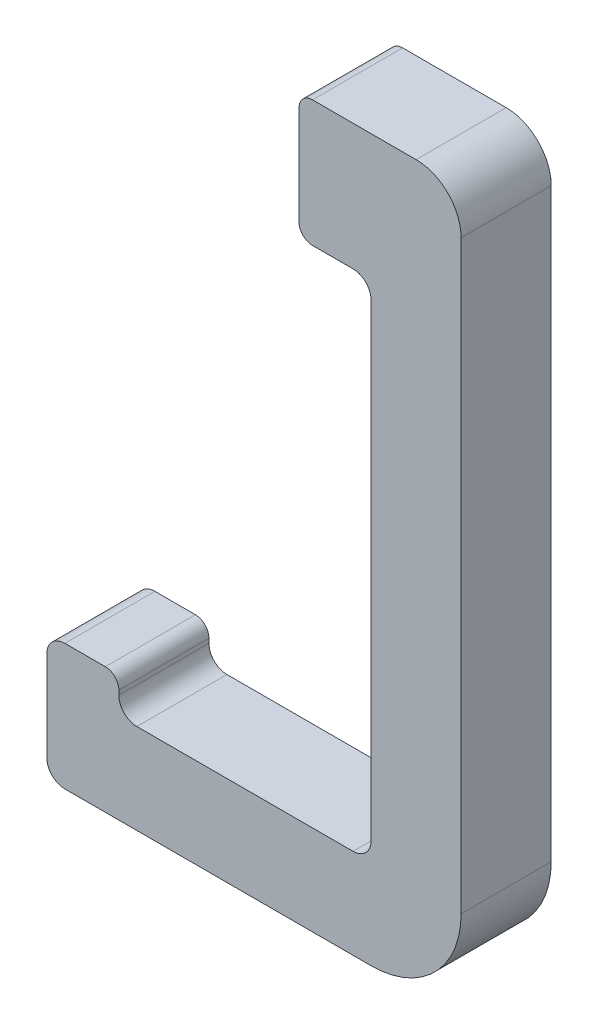
ISO-10303-21;
HEADER;
FILE_DESCRIPTION(('STEP AP214'),'2;1');
FILE_NAME('part.step','',(''),(''),'','','');
FILE_SCHEMA(('AUTOMOTIVE_DESIGN { 1 0 10303 214 1 1 1 1 }'));
ENDSEC;
DATA;
#1=APPLICATION_CONTEXT('core data for automotive mechanical design processes');
#2=APPLICATION_PROTOCOL_DEFINITION('international standard','automotive_design',2000,#1);
#3=PRODUCT_CONTEXT('',#1,'mechanical');
#4=PRODUCT('Part','Part','',(#3));
#5=PRODUCT_RELATED_PRODUCT_CATEGORY('part','',(#4));
#6=PRODUCT_DEFINITION_FORMATION('','',#4);
#7=PRODUCT_DEFINITION_CONTEXT('part definition',#1,'design');
#8=PRODUCT_DEFINITION('design','',#6,#7);
#9=PRODUCT_DEFINITION_SHAPE('','',#8);
#10=(LENGTH_UNIT() NAMED_UNIT(*) SI_UNIT(.MILLI.,.METRE.));
#11=(NAMED_UNIT(*) PLANE_ANGLE_UNIT() SI_UNIT($,.RADIAN.));
#12=(NAMED_UNIT(*) SI_UNIT($,.STERADIAN.) SOLID_ANGLE_UNIT());
#13=UNCERTAINTY_MEASURE_WITH_UNIT(LENGTH_MEASURE(1.E-05),#10,'distance_accuracy_value','');
#14=(GEOMETRIC_REPRESENTATION_CONTEXT(3) GLOBAL_UNCERTAINTY_ASSIGNED_CONTEXT((#13)) GLOBAL_UNIT_ASSIGNED_CONTEXT((#10,
#11,#12)) REPRESENTATION_CONTEXT('',''));
#15=CARTESIAN_POINT('',(0.,0.,0.));
#16=DIRECTION('',(0.,0.,1.));
#17=DIRECTION('',(1.,0.,0.));
#18=AXIS2_PLACEMENT_3D('',#15,#16,#17);
#19=CARTESIAN_POINT('',(-26.,12.,10.));
#20=DIRECTION('',(0.,0.,-1.));
#21=DIRECTION('',(-1.,0.,0.));
#22=AXIS2_PLACEMENT_3D('',#19,#20,#21);
#23=CYLINDRICAL_SURFACE('',#22,2.);
#24=CARTESIAN_POINT('',(-26.,12.,0.));
#25=DIRECTION('',(0.,0.,-1.));
#26=DIRECTION('',(1.,0.,0.));
#27=AXIS2_PLACEMENT_3D('',#24,#25,#26);
#28=CIRCLE('',#27,2.);
#29=CARTESIAN_POINT('',(-26.,10.,0.));
#30=VERTEX_POINT('',#29);
#31=CARTESIAN_POINT('',(-28.,12.,0.));
#32=VERTEX_POINT('',#31);
#33=EDGE_CURVE('E203',#30,#32,#28,.T.);
#34=ORIENTED_EDGE('',*,*,#33,.T.);
#35=DIRECTION('',(0.,0.,-1.));
#36=VECTOR('',#35,1.);
#37=CARTESIAN_POINT('',(-28.,12.,10.));
#38=LINE('',#37,#36);
#39=CARTESIAN_POINT('',(-28.,12.,10.));
#40=VERTEX_POINT('',#39);
#41=EDGE_CURVE('E11',#40,#32,#38,.T.);
#42=ORIENTED_EDGE('',*,*,#41,.F.);
#43=CARTESIAN_POINT('',(-26.,12.,10.));
#44=DIRECTION('',(0.,0.,-1.));
#45=DIRECTION('',(1.,0.,0.));
#46=AXIS2_PLACEMENT_3D('',#43,#44,#45);
#47=CIRCLE('',#46,2.);
#48=CARTESIAN_POINT('',(-26.,10.,10.));
#49=VERTEX_POINT('',#48);
#50=EDGE_CURVE('E243',#49,#40,#47,.T.);
#51=ORIENTED_EDGE('',*,*,#50,.F.);
#52=DIRECTION('',(0.,0.,-1.));
#53=VECTOR('',#52,1.);
#54=CARTESIAN_POINT('',(-26.,10.,10.));
#55=LINE('',#54,#53);
#56=EDGE_CURVE('E199',#49,#30,#55,.T.);
#57=ORIENTED_EDGE('',*,*,#56,.T.);
#58=EDGE_LOOP('',(#34,#42,#51,#57));
#59=FACE_BOUND('',#58,.T.);
#60=ADVANCED_FACE('F35',(#59),#23,.F.);
#61=CARTESIAN_POINT('',(-28.,12.5,10.));
#62=DIRECTION('',(-1.,0.,0.));
#63=DIRECTION('',(0.,0.,1.));
#64=AXIS2_PLACEMENT_3D('',#61,#62,#63);
#65=PLANE('',#64);
#66=DIRECTION('',(0.,1.,0.));
#67=VECTOR('',#66,1.);
#68=CARTESIAN_POINT('',(-28.,12.5,0.));
#69=LINE('',#68,#67);
#70=CARTESIAN_POINT('',(-28.,12.5,0.));
#71=VERTEX_POINT('',#70);
#72=EDGE_CURVE('E206',#32,#71,#69,.T.);
#73=ORIENTED_EDGE('',*,*,#72,.T.);
#74=DIRECTION('',(0.,0.,-1.));
#75=VECTOR('',#74,1.);
#76=CARTESIAN_POINT('',(-28.,12.5,10.));
#77=LINE('',#76,#75);
#78=CARTESIAN_POINT('',(-28.,12.5,10.));
#79=VERTEX_POINT('',#78);
#80=EDGE_CURVE('E43',#79,#71,#77,.T.);
#81=ORIENTED_EDGE('',*,*,#80,.F.);
#82=DIRECTION('',(0.,1.,0.));
#83=VECTOR('',#82,1.);
#84=CARTESIAN_POINT('',(-28.,12.5,10.));
#85=LINE('',#84,#83);
#86=EDGE_CURVE('E128',#40,#79,#85,.T.);
#87=ORIENTED_EDGE('',*,*,#86,.F.);
#88=ORIENTED_EDGE('',*,*,#41,.T.);
#89=EDGE_LOOP('',(#73,#81,#87,#88));
#90=FACE_BOUND('',#89,.T.);
#91=ADVANCED_FACE('F352',(#90),#65,.F.);
#92=CARTESIAN_POINT('',(-29.5,12.5,10.));
#93=DIRECTION('',(0.,0.,-1.));
#94=DIRECTION('',(-1.,0.,0.));
#95=AXIS2_PLACEMENT_3D('',#92,#93,#94);
#96=CYLINDRICAL_SURFACE('',#95,1.5);
#97=CARTESIAN_POINT('',(-29.5,12.5,0.));
#98=DIRECTION('',(0.,0.,1.));
#99=DIRECTION('',(1.,0.,0.));
#100=AXIS2_PLACEMENT_3D('',#97,#98,#99);
#101=CIRCLE('',#100,1.5);
#102=CARTESIAN_POINT('',(-29.5,14.,0.));
#103=VERTEX_POINT('',#102);
#104=EDGE_CURVE('E208',#71,#103,#101,.T.);
#105=ORIENTED_EDGE('',*,*,#104,.T.);
#106=DIRECTION('',(0.,0.,-1.));
#107=VECTOR('',#106,1.);
#108=CARTESIAN_POINT('',(-29.5,14.,10.));
#109=LINE('',#108,#107);
#110=CARTESIAN_POINT('',(-29.5,14.,10.));
#111=VERTEX_POINT('',#110);
#112=EDGE_CURVE('E286',#111,#103,#109,.T.);
#113=ORIENTED_EDGE('',*,*,#112,.F.);
#114=CARTESIAN_POINT('',(-29.5,12.5,10.));
#115=DIRECTION('',(0.,0.,1.));
#116=DIRECTION('',(1.,0.,0.));
#117=AXIS2_PLACEMENT_3D('',#114,#115,#116);
#118=CIRCLE('',#117,1.5);
#119=EDGE_CURVE('E294',#79,#111,#118,.T.);
#120=ORIENTED_EDGE('',*,*,#119,.F.);
#121=ORIENTED_EDGE('',*,*,#80,.T.);
#122=EDGE_LOOP('',(#105,#113,#120,#121));
#123=FACE_BOUND('',#122,.T.);
#124=ADVANCED_FACE('F292',(#123),#96,.T.);
#125=CARTESIAN_POINT('',(-29.5,14.,10.));
#126=DIRECTION('',(0.,-1.,0.));
#127=DIRECTION('',(0.,0.,-1.));
#128=AXIS2_PLACEMENT_3D('',#125,#126,#127);
#129=PLANE('',#128);
#130=DIRECTION('',(-1.,0.,0.));
#131=VECTOR('',#130,1.);
#132=CARTESIAN_POINT('',(-29.5,14.,0.));
#133=LINE('',#132,#131);
#134=CARTESIAN_POINT('',(-34.,14.,0.));
#135=VERTEX_POINT('',#134);
#136=EDGE_CURVE('E210',#103,#135,#133,.T.);
#137=ORIENTED_EDGE('',*,*,#136,.T.);
#138=DIRECTION('',(0.,0.,-1.));
#139=VECTOR('',#138,1.);
#140=CARTESIAN_POINT('',(-34.,14.,10.));
#141=LINE('',#140,#139);
#142=CARTESIAN_POINT('',(-34.,14.,10.));
#143=VERTEX_POINT('',#142);
#144=EDGE_CURVE('E283',#143,#135,#141,.T.);
#145=ORIENTED_EDGE('',*,*,#144,.F.);
#146=DIRECTION('',(-1.,0.,0.));
#147=VECTOR('',#146,1.);
#148=CARTESIAN_POINT('',(-29.5,14.,10.));
#149=LINE('',#148,#147);
#150=EDGE_CURVE('E310',#111,#143,#149,.T.);
#151=ORIENTED_EDGE('',*,*,#150,.F.);
#152=ORIENTED_EDGE('',*,*,#112,.T.);
#153=EDGE_LOOP('',(#137,#145,#151,#152));
#154=FACE_BOUND('',#153,.T.);
#155=ADVANCED_FACE('F301',(#154),#129,.F.);
#156=CARTESIAN_POINT('',(-34.,12.,10.));
#157=DIRECTION('',(0.,0.,-1.));
#158=DIRECTION('',(-1.,0.,0.));
#159=AXIS2_PLACEMENT_3D('',#156,#157,#158);
#160=CYLINDRICAL_SURFACE('',#159,2.);
#161=CARTESIAN_POINT('',(-34.,12.,0.));
#162=DIRECTION('',(0.,0.,1.));
#163=DIRECTION('',(1.,0.,0.));
#164=AXIS2_PLACEMENT_3D('',#161,#162,#163);
#165=CIRCLE('',#164,2.);
#166=CARTESIAN_POINT('',(-36.,12.,0.));
#167=VERTEX_POINT('',#166);
#168=EDGE_CURVE('E212',#135,#167,#165,.T.);
#169=ORIENTED_EDGE('',*,*,#168,.T.);
#170=DIRECTION('',(0.,0.,-1.));
#171=VECTOR('',#170,1.);
#172=CARTESIAN_POINT('',(-36.,12.,10.));
#173=LINE('',#172,#171);
#174=CARTESIAN_POINT('',(-36.,12.,10.));
#175=VERTEX_POINT('',#174);
#176=EDGE_CURVE('E280',#175,#167,#173,.T.);
#177=ORIENTED_EDGE('',*,*,#176,.F.);
#178=CARTESIAN_POINT('',(-34.,12.,10.));
#179=DIRECTION('',(0.,0.,1.));
#180=DIRECTION('',(1.,0.,0.));
#181=AXIS2_PLACEMENT_3D('',#178,#179,#180);
#182=CIRCLE('',#181,2.);
#183=EDGE_CURVE('E307',#143,#175,#182,.T.);
#184=ORIENTED_EDGE('',*,*,#183,.F.);
#185=ORIENTED_EDGE('',*,*,#144,.T.);
#186=EDGE_LOOP('',(#169,#177,#184,#185));
#187=FACE_BOUND('',#186,.T.);
#188=ADVANCED_FACE('F305',(#187),#160,.T.);
#189=CARTESIAN_POINT('',(-36.,12.,10.));
#190=DIRECTION('',(1.,0.,0.));
#191=DIRECTION('',(0.,1.,0.));
#192=AXIS2_PLACEMENT_3D('',#189,#190,#191);
#193=PLANE('',#192);
#194=DIRECTION('',(0.,-1.,0.));
#195=VECTOR('',#194,1.);
#196=CARTESIAN_POINT('',(-36.,12.,0.));
#197=LINE('',#196,#195);
#198=CARTESIAN_POINT('',(-36.,2.,0.));
#199=VERTEX_POINT('',#198);
#200=EDGE_CURVE('E214',#167,#199,#197,.T.);
#201=ORIENTED_EDGE('',*,*,#200,.T.);
#202=DIRECTION('',(0.,0.,-1.));
#203=VECTOR('',#202,1.);
#204=CARTESIAN_POINT('',(-36.,2.,10.));
#205=LINE('',#204,#203);
#206=CARTESIAN_POINT('',(-36.,2.,10.));
#207=VERTEX_POINT('',#206);
#208=EDGE_CURVE('E277',#207,#199,#205,.T.);
#209=ORIENTED_EDGE('',*,*,#208,.F.);
#210=DIRECTION('',(0.,-1.,0.));
#211=VECTOR('',#210,1.);
#212=CARTESIAN_POINT('',(-36.,12.,10.));
#213=LINE('',#212,#211);
#214=EDGE_CURVE('E309',#175,#207,#213,.T.);
#215=ORIENTED_EDGE('',*,*,#214,.F.);
#216=ORIENTED_EDGE('',*,*,#176,.T.);
#217=EDGE_LOOP('',(#201,#209,#215,#216));
#218=FACE_BOUND('',#217,.T.);
#219=ADVANCED_FACE('F364',(#218),#193,.F.);
#220=CARTESIAN_POINT('',(-34.,2.,10.));
#221=DIRECTION('',(0.,0.,-1.));
#222=DIRECTION('',(-1.,0.,0.));
#223=AXIS2_PLACEMENT_3D('',#220,#221,#222);
#224=CYLINDRICAL_SURFACE('',#223,2.);
#225=CARTESIAN_POINT('',(-34.,2.,0.));
#226=DIRECTION('',(0.,0.,1.));
#227=DIRECTION('',(1.,0.,0.));
#228=AXIS2_PLACEMENT_3D('',#225,#226,#227);
#229=CIRCLE('',#228,2.);
#230=CARTESIAN_POINT('',(-34.,0.,0.));
#231=VERTEX_POINT('',#230);
#232=EDGE_CURVE('E216',#199,#231,#229,.T.);
#233=ORIENTED_EDGE('',*,*,#232,.T.);
#234=DIRECTION('',(0.,0.,-1.));
#235=VECTOR('',#234,1.);
#236=CARTESIAN_POINT('',(-34.,0.,10.));
#237=LINE('',#236,#235);
#238=CARTESIAN_POINT('',(-34.,0.,10.));
#239=VERTEX_POINT('',#238);
#240=EDGE_CURVE('E274',#239,#231,#237,.T.);
#241=ORIENTED_EDGE('',*,*,#240,.F.);
#242=CARTESIAN_POINT('',(-34.,2.,10.));
#243=DIRECTION('',(0.,0.,1.));
#244=DIRECTION('',(1.,0.,0.));
#245=AXIS2_PLACEMENT_3D('',#242,#243,#244);
#246=CIRCLE('',#245,2.);
#247=EDGE_CURVE('E312',#207,#239,#246,.T.);
#248=ORIENTED_EDGE('',*,*,#247,.F.);
#249=ORIENTED_EDGE('',*,*,#208,.T.);
#250=EDGE_LOOP('',(#233,#241,#248,#249));
#251=FACE_BOUND('',#250,.T.);
#252=ADVANCED_FACE('F367',(#251),#224,.T.);
#253=CARTESIAN_POINT('',(-34.,0.,10.));
#254=DIRECTION('',(0.,1.,0.));
#255=DIRECTION('',(0.,0.,1.));
#256=AXIS2_PLACEMENT_3D('',#253,#254,#255);
#257=PLANE('',#256);
#258=DIRECTION('',(1.,0.,0.));
#259=VECTOR('',#258,1.);
#260=CARTESIAN_POINT('',(-34.,0.,0.));
#261=LINE('',#260,#259);
#262=CARTESIAN_POINT('',(0.,0.,0.));
#263=VERTEX_POINT('',#262);
#264=EDGE_CURVE('E218',#231,#263,#261,.T.);
#265=ORIENTED_EDGE('',*,*,#264,.T.);
#266=DIRECTION('',(0.,0.,-1.));
#267=VECTOR('',#266,1.);
#268=CARTESIAN_POINT('',(0.,0.,10.));
#269=LINE('',#268,#267);
#270=CARTESIAN_POINT('',(0.,0.,10.));
#271=VERTEX_POINT('',#270);
#272=EDGE_CURVE('E271',#271,#263,#269,.T.);
#273=ORIENTED_EDGE('',*,*,#272,.F.);
#274=DIRECTION('',(1.,0.,0.));
#275=VECTOR('',#274,1.);
#276=CARTESIAN_POINT('',(-34.,0.,10.));
#277=LINE('',#276,#275);
#278=EDGE_CURVE('E318',#239,#271,#277,.T.);
#279=ORIENTED_EDGE('',*,*,#278,.F.);
#280=ORIENTED_EDGE('',*,*,#240,.T.);
#281=EDGE_LOOP('',(#265,#273,#279,#280));
#282=FACE_BOUND('',#281,.T.);
#283=ADVANCED_FACE('F371',(#282),#257,.F.);
#284=CARTESIAN_POINT('',(0.,10.,10.));
#285=DIRECTION('',(0.,0.,-1.));
#286=DIRECTION('',(-1.,0.,0.));
#287=AXIS2_PLACEMENT_3D('',#284,#285,#286);
#288=CYLINDRICAL_SURFACE('',#287,10.);
#289=CARTESIAN_POINT('',(0.,10.,0.));
#290=DIRECTION('',(0.,0.,1.));
#291=DIRECTION('',(1.,0.,0.));
#292=AXIS2_PLACEMENT_3D('',#289,#290,#291);
#293=CIRCLE('',#292,10.);
#294=CARTESIAN_POINT('',(10.,10.,0.));
#295=VERTEX_POINT('',#294);
#296=EDGE_CURVE('E220',#263,#295,#293,.T.);
#297=ORIENTED_EDGE('',*,*,#296,.T.);
#298=DIRECTION('',(0.,0.,-1.));
#299=VECTOR('',#298,1.);
#300=CARTESIAN_POINT('',(10.,10.,10.));
#301=LINE('',#300,#299);
#302=CARTESIAN_POINT('',(10.,10.,10.));
#303=VERTEX_POINT('',#302);
#304=EDGE_CURVE('E268',#303,#295,#301,.T.);
#305=ORIENTED_EDGE('',*,*,#304,.F.);
#306=CARTESIAN_POINT('',(0.,10.,10.));
#307=DIRECTION('',(0.,0.,1.));
#308=DIRECTION('',(1.,0.,0.));
#309=AXIS2_PLACEMENT_3D('',#306,#307,#308);
#310=CIRCLE('',#309,10.);
#311=EDGE_CURVE('E320',#271,#303,#310,.T.);
#312=ORIENTED_EDGE('',*,*,#311,.F.);
#313=ORIENTED_EDGE('',*,*,#272,.T.);
#314=EDGE_LOOP('',(#297,#305,#312,#313));
#315=FACE_BOUND('',#314,.T.);
#316=ADVANCED_FACE('F375',(#315),#288,.T.);
#317=CARTESIAN_POINT('',(10.,10.,10.));
#318=DIRECTION('',(-1.,0.,0.));
#319=DIRECTION('',(0.,-1.,0.));
#320=AXIS2_PLACEMENT_3D('',#317,#318,#319);
#321=PLANE('',#320);
#322=DIRECTION('',(0.,1.,0.));
#323=VECTOR('',#322,1.);
#324=CARTESIAN_POINT('',(10.,10.,0.));
#325=LINE('',#324,#323);
#326=CARTESIAN_POINT('',(10.,75.,0.));
#327=VERTEX_POINT('',#326);
#328=EDGE_CURVE('E222',#295,#327,#325,.T.);
#329=ORIENTED_EDGE('',*,*,#328,.T.);
#330=DIRECTION('',(0.,0.,-1.));
#331=VECTOR('',#330,1.);
#332=CARTESIAN_POINT('',(10.,75.,10.));
#333=LINE('',#332,#331);
#334=CARTESIAN_POINT('',(10.,75.,10.));
#335=VERTEX_POINT('',#334);
#336=EDGE_CURVE('E265',#335,#327,#333,.T.);
#337=ORIENTED_EDGE('',*,*,#336,.F.);
#338=DIRECTION('',(0.,1.,0.));
#339=VECTOR('',#338,1.);
#340=CARTESIAN_POINT('',(10.,10.,10.));
#341=LINE('',#340,#339);
#342=EDGE_CURVE('E322',#303,#335,#341,.T.);
#343=ORIENTED_EDGE('',*,*,#342,.F.);
#344=ORIENTED_EDGE('',*,*,#304,.T.);
#345=EDGE_LOOP('',(#329,#337,#343,#344));
#346=FACE_BOUND('',#345,.T.);
#347=ADVANCED_FACE('F379',(#346),#321,.F.);
#348=CARTESIAN_POINT('',(5.00000000000001,75.,10.));
#349=DIRECTION('',(0.,0.,-1.));
#350=DIRECTION('',(-1.,0.,0.));
#351=AXIS2_PLACEMENT_3D('',#348,#349,#350);
#352=CYLINDRICAL_SURFACE('',#351,5.);
#353=CARTESIAN_POINT('',(5.00000000000001,75.,0.));
#354=DIRECTION('',(0.,0.,1.));
#355=DIRECTION('',(1.,0.,0.));
#356=AXIS2_PLACEMENT_3D('',#353,#354,#355);
#357=CIRCLE('',#356,5.);
#358=CARTESIAN_POINT('',(5.,80.,0.));
#359=VERTEX_POINT('',#358);
#360=EDGE_CURVE('E224',#327,#359,#357,.T.);
#361=ORIENTED_EDGE('',*,*,#360,.T.);
#362=DIRECTION('',(0.,0.,-1.));
#363=VECTOR('',#362,1.);
#364=CARTESIAN_POINT('',(5.,80.,10.));
#365=LINE('',#364,#363);
#366=CARTESIAN_POINT('',(5.,80.,10.));
#367=VERTEX_POINT('',#366);
#368=EDGE_CURVE('E262',#367,#359,#365,.T.);
#369=ORIENTED_EDGE('',*,*,#368,.F.);
#370=CARTESIAN_POINT('',(5.00000000000001,75.,10.));
#371=DIRECTION('',(0.,0.,1.));
#372=DIRECTION('',(1.,0.,0.));
#373=AXIS2_PLACEMENT_3D('',#370,#371,#372);
#374=CIRCLE('',#373,5.);
#375=EDGE_CURVE('E324',#335,#367,#374,.T.);
#376=ORIENTED_EDGE('',*,*,#375,.F.);
#377=ORIENTED_EDGE('',*,*,#336,.T.);
#378=EDGE_LOOP('',(#361,#369,#376,#377));
#379=FACE_BOUND('',#378,.T.);
#380=ADVANCED_FACE('F383',(#379),#352,.T.);
#381=CARTESIAN_POINT('',(5.,80.,10.));
#382=DIRECTION('',(0.,-1.,0.));
#383=DIRECTION('',(0.,0.,-1.));
#384=AXIS2_PLACEMENT_3D('',#381,#382,#383);
#385=PLANE('',#384);
#386=DIRECTION('',(-1.,0.,0.));
#387=VECTOR('',#386,1.);
#388=CARTESIAN_POINT('',(5.,80.,0.));
#389=LINE('',#388,#387);
#390=CARTESIAN_POINT('',(-6.49999999999999,80.,0.));
#391=VERTEX_POINT('',#390);
#392=EDGE_CURVE('E226',#359,#391,#389,.T.);
#393=ORIENTED_EDGE('',*,*,#392,.T.);
#394=DIRECTION('',(0.,0.,-1.));
#395=VECTOR('',#394,1.);
#396=CARTESIAN_POINT('',(-6.49999999999999,80.,10.));
#397=LINE('',#396,#395);
#398=CARTESIAN_POINT('',(-6.49999999999999,80.,10.));
#399=VERTEX_POINT('',#398);
#400=EDGE_CURVE('E259',#399,#391,#397,.T.);
#401=ORIENTED_EDGE('',*,*,#400,.F.);
#402=DIRECTION('',(-1.,0.,0.));
#403=VECTOR('',#402,1.);
#404=CARTESIAN_POINT('',(5.,80.,10.));
#405=LINE('',#404,#403);
#406=EDGE_CURVE('E326',#367,#399,#405,.T.);
#407=ORIENTED_EDGE('',*,*,#406,.F.);
#408=ORIENTED_EDGE('',*,*,#368,.T.);
#409=EDGE_LOOP('',(#393,#401,#407,#408));
#410=FACE_BOUND('',#409,.T.);
#411=ADVANCED_FACE('F387',(#410),#385,.F.);
#412=CARTESIAN_POINT('',(-6.49999999999999,78.5,10.));
#413=DIRECTION('',(0.,0.,-1.));
#414=DIRECTION('',(-1.,0.,0.));
#415=AXIS2_PLACEMENT_3D('',#412,#413,#414);
#416=CYLINDRICAL_SURFACE('',#415,1.5);
#417=CARTESIAN_POINT('',(-6.49999999999999,78.5,0.));
#418=DIRECTION('',(0.,0.,1.));
#419=DIRECTION('',(1.,0.,0.));
#420=AXIS2_PLACEMENT_3D('',#417,#418,#419);
#421=CIRCLE('',#420,1.5);
#422=CARTESIAN_POINT('',(-7.99999999999999,78.5,0.));
#423=VERTEX_POINT('',#422);
#424=EDGE_CURVE('E228',#391,#423,#421,.T.);
#425=ORIENTED_EDGE('',*,*,#424,.T.);
#426=DIRECTION('',(0.,0.,-1.));
#427=VECTOR('',#426,1.);
#428=CARTESIAN_POINT('',(-7.99999999999999,78.5,10.));
#429=LINE('',#428,#427);
#430=CARTESIAN_POINT('',(-7.99999999999999,78.5,10.));
#431=VERTEX_POINT('',#430);
#432=EDGE_CURVE('E256',#431,#423,#429,.T.);
#433=ORIENTED_EDGE('',*,*,#432,.F.);
#434=CARTESIAN_POINT('',(-6.49999999999999,78.5,10.));
#435=DIRECTION('',(0.,0.,1.));
#436=DIRECTION('',(1.,0.,0.));
#437=AXIS2_PLACEMENT_3D('',#434,#435,#436);
#438=CIRCLE('',#437,1.5);
#439=EDGE_CURVE('E328',#399,#431,#438,.T.);
#440=ORIENTED_EDGE('',*,*,#439,.F.);
#441=ORIENTED_EDGE('',*,*,#400,.T.);
#442=EDGE_LOOP('',(#425,#433,#440,#441));
#443=FACE_BOUND('',#442,.T.);
#444=ADVANCED_FACE('F391',(#443),#416,.T.);
#445=CARTESIAN_POINT('',(-7.99999999999999,78.5,10.));
#446=DIRECTION('',(1.,0.,0.));
#447=DIRECTION('',(0.,1.,0.));
#448=AXIS2_PLACEMENT_3D('',#445,#446,#447);
#449=PLANE('',#448);
#450=DIRECTION('',(0.,-1.,0.));
#451=VECTOR('',#450,1.);
#452=CARTESIAN_POINT('',(-7.99999999999999,78.5,0.));
#453=LINE('',#452,#451);
#454=CARTESIAN_POINT('',(-7.99999999999999,67.5,0.));
#455=VERTEX_POINT('',#454);
#456=EDGE_CURVE('E230',#423,#455,#453,.T.);
#457=ORIENTED_EDGE('',*,*,#456,.T.);
#458=DIRECTION('',(0.,0.,-1.));
#459=VECTOR('',#458,1.);
#460=CARTESIAN_POINT('',(-7.99999999999999,67.5,10.));
#461=LINE('',#460,#459);
#462=CARTESIAN_POINT('',(-7.99999999999999,67.5,10.));
#463=VERTEX_POINT('',#462);
#464=EDGE_CURVE('E253',#463,#455,#461,.T.);
#465=ORIENTED_EDGE('',*,*,#464,.F.);
#466=DIRECTION('',(0.,-1.,0.));
#467=VECTOR('',#466,1.);
#468=CARTESIAN_POINT('',(-7.99999999999999,78.5,10.));
#469=LINE('',#468,#467);
#470=EDGE_CURVE('E330',#431,#463,#469,.T.);
#471=ORIENTED_EDGE('',*,*,#470,.F.);
#472=ORIENTED_EDGE('',*,*,#432,.T.);
#473=EDGE_LOOP('',(#457,#465,#471,#472));
#474=FACE_BOUND('',#473,.T.);
#475=ADVANCED_FACE('F395',(#474),#449,.F.);
#476=CARTESIAN_POINT('',(-6.49999999999999,67.5,10.));
#477=DIRECTION('',(0.,0.,-1.));
#478=DIRECTION('',(-1.,0.,0.));
#479=AXIS2_PLACEMENT_3D('',#476,#477,#478);
#480=CYLINDRICAL_SURFACE('',#479,1.5);
#481=CARTESIAN_POINT('',(-6.49999999999999,67.5,0.));
#482=DIRECTION('',(0.,0.,1.));
#483=DIRECTION('',(1.,0.,0.));
#484=AXIS2_PLACEMENT_3D('',#481,#482,#483);
#485=CIRCLE('',#484,1.5);
#486=CARTESIAN_POINT('',(-6.49999999999999,66.,0.));
#487=VERTEX_POINT('',#486);
#488=EDGE_CURVE('E232',#455,#487,#485,.T.);
#489=ORIENTED_EDGE('',*,*,#488,.T.);
#490=DIRECTION('',(0.,0.,-1.));
#491=VECTOR('',#490,1.);
#492=CARTESIAN_POINT('',(-6.49999999999999,66.,10.));
#493=LINE('',#492,#491);
#494=CARTESIAN_POINT('',(-6.49999999999999,66.,10.));
#495=VERTEX_POINT('',#494);
#496=EDGE_CURVE('E250',#495,#487,#493,.T.);
#497=ORIENTED_EDGE('',*,*,#496,.F.);
#498=CARTESIAN_POINT('',(-6.49999999999999,67.5,10.));
#499=DIRECTION('',(0.,0.,1.));
#500=DIRECTION('',(1.,0.,0.));
#501=AXIS2_PLACEMENT_3D('',#498,#499,#500);
#502=CIRCLE('',#501,1.5);
#503=EDGE_CURVE('E332',#463,#495,#502,.T.);
#504=ORIENTED_EDGE('',*,*,#503,.F.);
#505=ORIENTED_EDGE('',*,*,#464,.T.);
#506=EDGE_LOOP('',(#489,#497,#504,#505));
#507=FACE_BOUND('',#506,.T.);
#508=ADVANCED_FACE('F399',(#507),#480,.T.);
#509=CARTESIAN_POINT('',(-6.49999999999999,66.,10.));
#510=DIRECTION('',(0.,1.,0.));
#511=DIRECTION('',(0.,0.,1.));
#512=AXIS2_PLACEMENT_3D('',#509,#510,#511);
#513=PLANE('',#512);
#514=DIRECTION('',(1.,0.,0.));
#515=VECTOR('',#514,1.);
#516=CARTESIAN_POINT('',(-6.49999999999999,66.,0.));
#517=LINE('',#516,#515);
#518=CARTESIAN_POINT('',(-2.00000000000001,66.,0.));
#519=VERTEX_POINT('',#518);
#520=EDGE_CURVE('E234',#487,#519,#517,.T.);
#521=ORIENTED_EDGE('',*,*,#520,.T.);
#522=DIRECTION('',(0.,0.,-1.));
#523=VECTOR('',#522,1.);
#524=CARTESIAN_POINT('',(-2.00000000000001,66.,10.));
#525=LINE('',#524,#523);
#526=CARTESIAN_POINT('',(-2.00000000000001,66.,10.));
#527=VERTEX_POINT('',#526);
#528=EDGE_CURVE('E247',#527,#519,#525,.T.);
#529=ORIENTED_EDGE('',*,*,#528,.F.);
#530=DIRECTION('',(1.,0.,0.));
#531=VECTOR('',#530,1.);
#532=CARTESIAN_POINT('',(-6.49999999999999,66.,10.));
#533=LINE('',#532,#531);
#534=EDGE_CURVE('E334',#495,#527,#533,.T.);
#535=ORIENTED_EDGE('',*,*,#534,.F.);
#536=ORIENTED_EDGE('',*,*,#496,.T.);
#537=EDGE_LOOP('',(#521,#529,#535,#536));
#538=FACE_BOUND('',#537,.T.);
#539=ADVANCED_FACE('F340',(#538),#513,.F.);
#540=CARTESIAN_POINT('',(-2.,64.,10.));
#541=DIRECTION('',(0.,0.,-1.));
#542=DIRECTION('',(-1.,0.,0.));
#543=AXIS2_PLACEMENT_3D('',#540,#541,#542);
#544=CYLINDRICAL_SURFACE('',#543,2.);
#545=CARTESIAN_POINT('',(-2.,64.,0.));
#546=DIRECTION('',(0.,0.,-1.));
#547=DIRECTION('',(-1.,0.,0.));
#548=AXIS2_PLACEMENT_3D('',#545,#546,#547);
#549=CIRCLE('',#548,2.);
#550=CARTESIAN_POINT('',(0.,64.,0.));
#551=VERTEX_POINT('',#550);
#552=EDGE_CURVE('E236',#519,#551,#549,.T.);
#553=ORIENTED_EDGE('',*,*,#552,.T.);
#554=DIRECTION('',(0.,0.,-1.));
#555=VECTOR('',#554,1.);
#556=CARTESIAN_POINT('',(0.,64.,10.));
#557=LINE('',#556,#555);
#558=CARTESIAN_POINT('',(0.,64.,10.));
#559=VERTEX_POINT('',#558);
#560=EDGE_CURVE('E194',#559,#551,#557,.T.);
#561=ORIENTED_EDGE('',*,*,#560,.F.);
#562=CARTESIAN_POINT('',(-2.,64.,10.));
#563=DIRECTION('',(0.,0.,-1.));
#564=DIRECTION('',(-1.,0.,0.));
#565=AXIS2_PLACEMENT_3D('',#562,#563,#564);
#566=CIRCLE('',#565,2.);
#567=EDGE_CURVE('E184',#527,#559,#566,.T.);
#568=ORIENTED_EDGE('',*,*,#567,.F.);
#569=ORIENTED_EDGE('',*,*,#528,.T.);
#570=EDGE_LOOP('',(#553,#561,#568,#569));
#571=FACE_BOUND('',#570,.T.);
#572=ADVANCED_FACE('F344',(#571),#544,.F.);
#573=CARTESIAN_POINT('',(0.,12.,10.));
#574=DIRECTION('',(1.,0.,0.));
#575=DIRECTION('',(0.,0.,-1.));
#576=AXIS2_PLACEMENT_3D('',#573,#574,#575);
#577=PLANE('',#576);
#578=DIRECTION('',(0.,-1.,0.));
#579=VECTOR('',#578,1.);
#580=CARTESIAN_POINT('',(0.,12.,0.));
#581=LINE('',#580,#579);
#582=CARTESIAN_POINT('',(0.,12.,0.));
#583=VERTEX_POINT('',#582);
#584=EDGE_CURVE('E192',#551,#583,#581,.T.);
#585=ORIENTED_EDGE('',*,*,#584,.T.);
#586=DIRECTION('',(0.,0.,-1.));
#587=VECTOR('',#586,1.);
#588=CARTESIAN_POINT('',(0.,12.,10.));
#589=LINE('',#588,#587);
#590=CARTESIAN_POINT('',(0.,12.,10.));
#591=VERTEX_POINT('',#590);
#592=EDGE_CURVE('E190',#591,#583,#589,.T.);
#593=ORIENTED_EDGE('',*,*,#592,.F.);
#594=DIRECTION('',(0.,-1.,0.));
#595=VECTOR('',#594,1.);
#596=CARTESIAN_POINT('',(0.,64.,10.));
#597=LINE('',#596,#595);
#598=EDGE_CURVE('E177',#559,#591,#597,.T.);
#599=ORIENTED_EDGE('',*,*,#598,.F.);
#600=ORIENTED_EDGE('',*,*,#560,.T.);
#601=EDGE_LOOP('',(#585,#593,#599,#600));
#602=FACE_BOUND('',#601,.T.);
#603=ADVANCED_FACE('F191',(#602),#577,.F.);
#604=CARTESIAN_POINT('',(-1.99999999999999,12.,10.));
#605=DIRECTION('',(0.,0.,-1.));
#606=DIRECTION('',(-1.,0.,0.));
#607=AXIS2_PLACEMENT_3D('',#604,#605,#606);
#608=CYLINDRICAL_SURFACE('',#607,2.);
#609=CARTESIAN_POINT('',(-1.99999999999999,12.,0.));
#610=DIRECTION('',(0.,0.,-1.));
#611=DIRECTION('',(1.,0.,0.));
#612=AXIS2_PLACEMENT_3D('',#609,#610,#611);
#613=CIRCLE('',#612,2.);
#614=CARTESIAN_POINT('',(-2.00000000000001,10.,0.));
#615=VERTEX_POINT('',#614);
#616=EDGE_CURVE('E240',#583,#615,#613,.T.);
#617=ORIENTED_EDGE('',*,*,#616,.T.);
#618=DIRECTION('',(0.,0.,-1.));
#619=VECTOR('',#618,1.);
#620=CARTESIAN_POINT('',(-2.00000000000001,10.,10.));
#621=LINE('',#620,#619);
#622=CARTESIAN_POINT('',(-2.00000000000001,10.,10.));
#623=VERTEX_POINT('',#622);
#624=EDGE_CURVE('E195',#623,#615,#621,.T.);
#625=ORIENTED_EDGE('',*,*,#624,.F.);
#626=CARTESIAN_POINT('',(-1.99999999999999,12.,10.));
#627=DIRECTION('',(0.,0.,-1.));
#628=DIRECTION('',(1.,0.,0.));
#629=AXIS2_PLACEMENT_3D('',#626,#627,#628);
#630=CIRCLE('',#629,2.);
#631=EDGE_CURVE('E181',#591,#623,#630,.T.);
#632=ORIENTED_EDGE('',*,*,#631,.F.);
#633=ORIENTED_EDGE('',*,*,#592,.T.);
#634=EDGE_LOOP('',(#617,#625,#632,#633));
#635=FACE_BOUND('',#634,.T.);
#636=ADVANCED_FACE('F197',(#635),#608,.F.);
#637=CARTESIAN_POINT('',(-26.,10.,10.));
#638=DIRECTION('',(0.,-1.,0.));
#639=DIRECTION('',(1.,0.,0.));
#640=AXIS2_PLACEMENT_3D('',#637,#638,#639);
#641=PLANE('',#640);
#642=DIRECTION('',(-1.,0.,0.));
#643=VECTOR('',#642,1.);
#644=CARTESIAN_POINT('',(-26.,10.,0.));
#645=LINE('',#644,#643);
#646=EDGE_CURVE('E116',#615,#30,#645,.T.);
#647=ORIENTED_EDGE('',*,*,#646,.T.);
#648=ORIENTED_EDGE('',*,*,#56,.F.);
#649=DIRECTION('',(-1.,0.,0.));
#650=VECTOR('',#649,1.);
#651=CARTESIAN_POINT('',(-6.49999999999999,10.,10.));
#652=LINE('',#651,#650);
#653=EDGE_CURVE('E51',#623,#49,#652,.T.);
#654=ORIENTED_EDGE('',*,*,#653,.F.);
#655=ORIENTED_EDGE('',*,*,#624,.T.);
#656=EDGE_LOOP('',(#647,#648,#654,#655));
#657=FACE_BOUND('',#656,.T.);
#658=ADVANCED_FACE('F346',(#657),#641,.F.);
#659=CARTESIAN_POINT('',(-26.,12.,10.));
#660=DIRECTION('',(0.,0.,1.));
#661=DIRECTION('',(1.,0.,0.));
#662=AXIS2_PLACEMENT_3D('',#659,#660,#661);
#663=PLANE('',#662);
#664=ORIENTED_EDGE('',*,*,#50,.T.);
#665=ORIENTED_EDGE('',*,*,#86,.T.);
#666=ORIENTED_EDGE('',*,*,#119,.T.);
#667=ORIENTED_EDGE('',*,*,#150,.T.);
#668=ORIENTED_EDGE('',*,*,#183,.T.);
#669=ORIENTED_EDGE('',*,*,#214,.T.);
#670=ORIENTED_EDGE('',*,*,#247,.T.);
#671=ORIENTED_EDGE('',*,*,#278,.T.);
#672=ORIENTED_EDGE('',*,*,#311,.T.);
#673=ORIENTED_EDGE('',*,*,#342,.T.);
#674=ORIENTED_EDGE('',*,*,#375,.T.);
#675=ORIENTED_EDGE('',*,*,#406,.T.);
#676=ORIENTED_EDGE('',*,*,#439,.T.);
#677=ORIENTED_EDGE('',*,*,#470,.T.);
#678=ORIENTED_EDGE('',*,*,#503,.T.);
#679=ORIENTED_EDGE('',*,*,#534,.T.);
#680=ORIENTED_EDGE('',*,*,#567,.T.);
#681=ORIENTED_EDGE('',*,*,#598,.T.);
#682=ORIENTED_EDGE('',*,*,#631,.T.);
#683=ORIENTED_EDGE('',*,*,#653,.T.);
#684=EDGE_LOOP('',(#664,#665,#666,#667,#668,#669,#670,#671,#672,#673,#674,#675,#676,#677,#678,
#679,#680,#681,#682,#683));
#685=FACE_BOUND('',#684,.T.);
#686=ADVANCED_FACE('F179',(#685),#663,.T.);
#687=CARTESIAN_POINT('',(-26.,12.,0.));
#688=DIRECTION('',(0.,0.,1.));
#689=DIRECTION('',(1.,0.,0.));
#690=AXIS2_PLACEMENT_3D('',#687,#688,#689);
#691=PLANE('',#690);
#692=ORIENTED_EDGE('',*,*,#33,.F.);
#693=ORIENTED_EDGE('',*,*,#646,.F.);
#694=ORIENTED_EDGE('',*,*,#616,.F.);
#695=ORIENTED_EDGE('',*,*,#584,.F.);
#696=ORIENTED_EDGE('',*,*,#552,.F.);
#697=ORIENTED_EDGE('',*,*,#520,.F.);
#698=ORIENTED_EDGE('',*,*,#488,.F.);
#699=ORIENTED_EDGE('',*,*,#456,.F.);
#700=ORIENTED_EDGE('',*,*,#424,.F.);
#701=ORIENTED_EDGE('',*,*,#392,.F.);
#702=ORIENTED_EDGE('',*,*,#360,.F.);
#703=ORIENTED_EDGE('',*,*,#328,.F.);
#704=ORIENTED_EDGE('',*,*,#296,.F.);
#705=ORIENTED_EDGE('',*,*,#264,.F.);
#706=ORIENTED_EDGE('',*,*,#232,.F.);
#707=ORIENTED_EDGE('',*,*,#200,.F.);
#708=ORIENTED_EDGE('',*,*,#168,.F.);
#709=ORIENTED_EDGE('',*,*,#136,.F.);
#710=ORIENTED_EDGE('',*,*,#104,.F.);
#711=ORIENTED_EDGE('',*,*,#72,.F.);
#712=EDGE_LOOP('',(#692,#693,#694,#695,#696,#697,#698,#699,#700,#701,#702,#703,#704,#705,#706,
#707,#708,#709,#710,#711));
#713=FACE_BOUND('',#712,.T.);
#714=ADVANCED_FACE('F296',(#713),#691,.F.);
#715=CLOSED_SHELL('',(#60,#91,#124,#155,#188,#219,#252,#283,#316,#347,#380,#411,#444,#475,#508,
#539,#572,#603,#636,#658,#686,#714));
#716=MANIFOLD_SOLID_BREP('B2',#715);
#717=ADVANCED_BREP_SHAPE_REPRESENTATION('',(#18,#716),#14);
#718=SHAPE_DEFINITION_REPRESENTATION(#9,#717);
ENDSEC;
END-ISO-10303-21;
